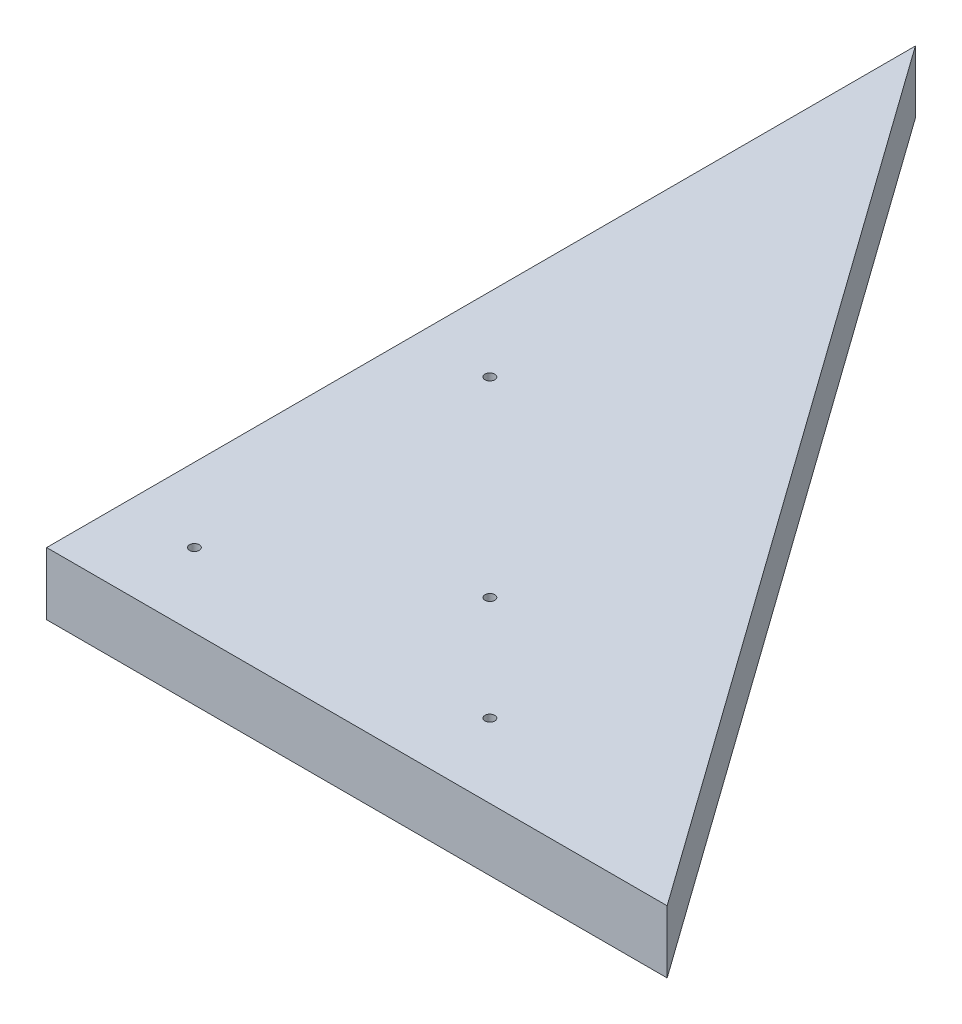
ISO-10303-21;
HEADER;
FILE_DESCRIPTION(('STEP AP214'),'2;1');
FILE_NAME('part.step','',(''),(''),'','','');
FILE_SCHEMA(('AUTOMOTIVE_DESIGN { 1 0 10303 214 1 1 1 1 }'));
ENDSEC;
DATA;
#1=APPLICATION_CONTEXT('core data for automotive mechanical design processes');
#2=APPLICATION_PROTOCOL_DEFINITION('international standard','automotive_design',2000,#1);
#3=PRODUCT_CONTEXT('',#1,'mechanical');
#4=PRODUCT('Part','Part','',(#3));
#5=PRODUCT_RELATED_PRODUCT_CATEGORY('part','',(#4));
#6=PRODUCT_DEFINITION_FORMATION('','',#4);
#7=PRODUCT_DEFINITION_CONTEXT('part definition',#1,'design');
#8=PRODUCT_DEFINITION('design','',#6,#7);
#9=PRODUCT_DEFINITION_SHAPE('','',#8);
#10=(LENGTH_UNIT() NAMED_UNIT(*) SI_UNIT(.MILLI.,.METRE.));
#11=(NAMED_UNIT(*) PLANE_ANGLE_UNIT() SI_UNIT($,.RADIAN.));
#12=(NAMED_UNIT(*) SI_UNIT($,.STERADIAN.) SOLID_ANGLE_UNIT());
#13=UNCERTAINTY_MEASURE_WITH_UNIT(LENGTH_MEASURE(1.E-05),#10,'distance_accuracy_value','');
#14=(GEOMETRIC_REPRESENTATION_CONTEXT(3) GLOBAL_UNCERTAINTY_ASSIGNED_CONTEXT((#13)) GLOBAL_UNIT_ASSIGNED_CONTEXT((#10,
#11,#12)) REPRESENTATION_CONTEXT('',''));
#15=CARTESIAN_POINT('',(0.,0.,0.));
#16=DIRECTION('',(0.,0.,1.));
#17=DIRECTION('',(1.,0.,0.));
#18=AXIS2_PLACEMENT_3D('',#15,#16,#17);
#19=CARTESIAN_POINT('',(-30.,229.478596729474,30.));
#20=DIRECTION('',(0.,-1.,0.));
#21=DIRECTION('',(0.,0.,-1.));
#22=AXIS2_PLACEMENT_3D('',#19,#20,#21);
#23=CYLINDRICAL_SURFACE('',#22,0.999999999999998);
#24=CARTESIAN_POINT('',(-30.,0.,30.));
#25=DIRECTION('',(0.,1.,0.));
#26=DIRECTION('',(0.,0.,1.));
#27=AXIS2_PLACEMENT_3D('',#24,#25,#26);
#28=CIRCLE('',#27,0.999999999999998);
#29=CARTESIAN_POINT('',(-30.,0.,31.));
#30=VERTEX_POINT('',#29);
#31=EDGE_CURVE('E95',#30,#30,#28,.T.);
#32=ORIENTED_EDGE('',*,*,#31,.F.);
#33=EDGE_LOOP('',(#32));
#34=FACE_BOUND('',#33,.T.);
#35=CARTESIAN_POINT('',(-30.,12.7,30.));
#36=DIRECTION('',(0.,1.,0.));
#37=DIRECTION('',(0.,0.,1.));
#38=AXIS2_PLACEMENT_3D('',#35,#36,#37);
#39=CIRCLE('',#38,0.999999999999998);
#40=CARTESIAN_POINT('',(-30.,12.7,31.));
#41=VERTEX_POINT('',#40);
#42=EDGE_CURVE('E86',#41,#41,#39,.T.);
#43=ORIENTED_EDGE('',*,*,#42,.T.);
#44=EDGE_LOOP('',(#43));
#45=FACE_BOUND('',#44,.T.);
#46=ADVANCED_FACE('F33',(#34,#45),#23,.F.);
#47=CARTESIAN_POINT('',(-45.,229.478596729474,45.));
#48=DIRECTION('',(1.,0.,0.));
#49=DIRECTION('',(0.,0.,-1.));
#50=AXIS2_PLACEMENT_3D('',#47,#48,#49);
#51=PLANE('',#50);
#52=DIRECTION('',(0.,0.,1.));
#53=VECTOR('',#52,1.);
#54=CARTESIAN_POINT('',(-45.,12.7,45.));
#55=LINE('',#54,#53);
#56=CARTESIAN_POINT('',(-45.,12.7,-131.4));
#57=VERTEX_POINT('',#56);
#58=CARTESIAN_POINT('',(-45.,12.7,45.));
#59=VERTEX_POINT('',#58);
#60=EDGE_CURVE('E69',#57,#59,#55,.T.);
#61=ORIENTED_EDGE('',*,*,#60,.F.);
#62=DIRECTION('',(0.,-1.,0.));
#63=VECTOR('',#62,1.);
#64=CARTESIAN_POINT('',(-45.,229.478596729474,-131.4));
#65=LINE('',#64,#63);
#66=CARTESIAN_POINT('',(-45.,0.,-131.4));
#67=VERTEX_POINT('',#66);
#68=EDGE_CURVE('E42',#57,#67,#65,.T.);
#69=ORIENTED_EDGE('',*,*,#68,.T.);
#70=DIRECTION('',(0.,0.,1.));
#71=VECTOR('',#70,1.);
#72=CARTESIAN_POINT('',(-45.,0.,45.));
#73=LINE('',#72,#71);
#74=CARTESIAN_POINT('',(-45.,0.,45.));
#75=VERTEX_POINT('',#74);
#76=EDGE_CURVE('E71',#67,#75,#73,.T.);
#77=ORIENTED_EDGE('',*,*,#76,.T.);
#78=DIRECTION('',(0.,-1.,0.));
#79=VECTOR('',#78,1.);
#80=CARTESIAN_POINT('',(-45.,229.478596729474,45.));
#81=LINE('',#80,#79);
#82=EDGE_CURVE('E65',#59,#75,#81,.T.);
#83=ORIENTED_EDGE('',*,*,#82,.F.);
#84=EDGE_LOOP('',(#61,#69,#77,#83));
#85=FACE_BOUND('',#84,.T.);
#86=ADVANCED_FACE('F67',(#85),#51,.F.);
#87=CARTESIAN_POINT('',(-45.,229.478596729474,-131.4));
#88=DIRECTION('',(-0.813733471206735,0.,0.581238193719096));
#89=DIRECTION('',(0.581238193719096,0.,0.813733471206735));
#90=AXIS2_PLACEMENT_3D('',#87,#88,#89);
#91=PLANE('',#90);
#92=DIRECTION('',(-0.581238193719096,0.,-0.813733471206735));
#93=VECTOR('',#92,1.);
#94=CARTESIAN_POINT('',(-45.,12.7,-131.4));
#95=LINE('',#94,#93);
#96=CARTESIAN_POINT('',(81.,12.7,45.));
#97=VERTEX_POINT('',#96);
#98=EDGE_CURVE('E52',#97,#57,#95,.T.);
#99=ORIENTED_EDGE('',*,*,#98,.F.);
#100=DIRECTION('',(0.,-1.,0.));
#101=VECTOR('',#100,1.);
#102=CARTESIAN_POINT('',(81.,229.478596729474,45.));
#103=LINE('',#102,#101);
#104=CARTESIAN_POINT('',(81.,0.,45.));
#105=VERTEX_POINT('',#104);
#106=EDGE_CURVE('E11',#97,#105,#103,.T.);
#107=ORIENTED_EDGE('',*,*,#106,.T.);
#108=DIRECTION('',(-0.581238193719096,0.,-0.813733471206735));
#109=VECTOR('',#108,1.);
#110=CARTESIAN_POINT('',(-45.,0.,-131.4));
#111=LINE('',#110,#109);
#112=EDGE_CURVE('E103',#105,#67,#111,.T.);
#113=ORIENTED_EDGE('',*,*,#112,.T.);
#114=ORIENTED_EDGE('',*,*,#68,.F.);
#115=EDGE_LOOP('',(#99,#107,#113,#114));
#116=FACE_BOUND('',#115,.T.);
#117=ADVANCED_FACE('F107',(#116),#91,.F.);
#118=CARTESIAN_POINT('',(81.,229.478596729474,45.));
#119=DIRECTION('',(0.,0.,-1.));
#120=DIRECTION('',(-1.,0.,0.));
#121=AXIS2_PLACEMENT_3D('',#118,#119,#120);
#122=PLANE('',#121);
#123=DIRECTION('',(1.,0.,0.));
#124=VECTOR('',#123,1.);
#125=CARTESIAN_POINT('',(81.,12.7,45.));
#126=LINE('',#125,#124);
#127=EDGE_CURVE('E77',#59,#97,#126,.T.);
#128=ORIENTED_EDGE('',*,*,#127,.F.);
#129=ORIENTED_EDGE('',*,*,#82,.T.);
#130=DIRECTION('',(1.,0.,0.));
#131=VECTOR('',#130,1.);
#132=CARTESIAN_POINT('',(81.,0.,45.));
#133=LINE('',#132,#131);
#134=EDGE_CURVE('E101',#75,#105,#133,.T.);
#135=ORIENTED_EDGE('',*,*,#134,.T.);
#136=ORIENTED_EDGE('',*,*,#106,.F.);
#137=EDGE_LOOP('',(#128,#129,#135,#136));
#138=FACE_BOUND('',#137,.T.);
#139=ADVANCED_FACE('F35',(#138),#122,.F.);
#140=CARTESIAN_POINT('',(-30.,229.478596729474,-30.));
#141=DIRECTION('',(0.,-1.,0.));
#142=DIRECTION('',(0.,0.,-1.));
#143=AXIS2_PLACEMENT_3D('',#140,#141,#142);
#144=CYLINDRICAL_SURFACE('',#143,0.999999999999998);
#145=CARTESIAN_POINT('',(-30.,0.,-30.));
#146=DIRECTION('',(0.,1.,0.));
#147=DIRECTION('',(0.,0.,1.));
#148=AXIS2_PLACEMENT_3D('',#145,#146,#147);
#149=CIRCLE('',#148,0.999999999999998);
#150=CARTESIAN_POINT('',(-30.,0.,-29.));
#151=VERTEX_POINT('',#150);
#152=EDGE_CURVE('E98',#151,#151,#149,.T.);
#153=ORIENTED_EDGE('',*,*,#152,.F.);
#154=EDGE_LOOP('',(#153));
#155=FACE_BOUND('',#154,.T.);
#156=CARTESIAN_POINT('',(-30.,12.7,-30.));
#157=DIRECTION('',(0.,1.,0.));
#158=DIRECTION('',(0.,0.,1.));
#159=AXIS2_PLACEMENT_3D('',#156,#157,#158);
#160=CIRCLE('',#159,0.999999999999998);
#161=CARTESIAN_POINT('',(-30.,12.7,-29.));
#162=VERTEX_POINT('',#161);
#163=EDGE_CURVE('E82',#162,#162,#160,.T.);
#164=ORIENTED_EDGE('',*,*,#163,.T.);
#165=EDGE_LOOP('',(#164));
#166=FACE_BOUND('',#165,.T.);
#167=ADVANCED_FACE('F140',(#155,#166),#144,.F.);
#168=CARTESIAN_POINT('',(8.78679656440357,229.478596729474,8.78679656440358));
#169=DIRECTION('',(0.,-1.,0.));
#170=DIRECTION('',(0.,0.,-1.));
#171=AXIS2_PLACEMENT_3D('',#168,#169,#170);
#172=CYLINDRICAL_SURFACE('',#171,1.);
#173=CARTESIAN_POINT('',(8.78679656440357,0.,8.78679656440358));
#174=DIRECTION('',(0.,1.,0.));
#175=DIRECTION('',(0.,0.,1.));
#176=AXIS2_PLACEMENT_3D('',#173,#174,#175);
#177=CIRCLE('',#176,1.);
#178=CARTESIAN_POINT('',(8.78679656440357,0.,9.78679656440358));
#179=VERTEX_POINT('',#178);
#180=EDGE_CURVE('E92',#179,#179,#177,.T.);
#181=ORIENTED_EDGE('',*,*,#180,.F.);
#182=EDGE_LOOP('',(#181));
#183=FACE_BOUND('',#182,.T.);
#184=CARTESIAN_POINT('',(8.78679656440357,12.7,8.78679656440358));
#185=DIRECTION('',(0.,1.,0.));
#186=DIRECTION('',(0.,0.,1.));
#187=AXIS2_PLACEMENT_3D('',#184,#185,#186);
#188=CIRCLE('',#187,1.);
#189=CARTESIAN_POINT('',(8.78679656440357,12.7,9.78679656440358));
#190=VERTEX_POINT('',#189);
#191=EDGE_CURVE('E126',#190,#190,#188,.T.);
#192=ORIENTED_EDGE('',*,*,#191,.T.);
#193=EDGE_LOOP('',(#192));
#194=FACE_BOUND('',#193,.T.);
#195=ADVANCED_FACE('F113',(#183,#194),#172,.F.);
#196=CARTESIAN_POINT('',(0.,0.,0.));
#197=DIRECTION('',(0.,-1.,0.));
#198=DIRECTION('',(0.,0.,-1.));
#199=AXIS2_PLACEMENT_3D('',#196,#197,#198);
#200=PLANE('',#199);
#201=ORIENTED_EDGE('',*,*,#180,.T.);
#202=EDGE_LOOP('',(#201));
#203=FACE_BOUND('',#202,.T.);
#204=ORIENTED_EDGE('',*,*,#152,.T.);
#205=EDGE_LOOP('',(#204));
#206=FACE_BOUND('',#205,.T.);
#207=ORIENTED_EDGE('',*,*,#134,.F.);
#208=ORIENTED_EDGE('',*,*,#76,.F.);
#209=ORIENTED_EDGE('',*,*,#112,.F.);
#210=EDGE_LOOP('',(#207,#208,#209));
#211=FACE_BOUND('',#210,.T.);
#212=ORIENTED_EDGE('',*,*,#31,.T.);
#213=EDGE_LOOP('',(#212));
#214=FACE_BOUND('',#213,.T.);
#215=CARTESIAN_POINT('',(30.,0.,30.));
#216=DIRECTION('',(0.,1.,0.));
#217=DIRECTION('',(0.,0.,1.));
#218=AXIS2_PLACEMENT_3D('',#215,#216,#217);
#219=CIRCLE('',#218,0.999999999999998);
#220=CARTESIAN_POINT('',(30.,0.,31.));
#221=VERTEX_POINT('',#220);
#222=EDGE_CURVE('E79',#221,#221,#219,.T.);
#223=ORIENTED_EDGE('',*,*,#222,.T.);
#224=EDGE_LOOP('',(#223));
#225=FACE_BOUND('',#224,.T.);
#226=ADVANCED_FACE('F109',(#203,#206,#211,#214,#225),#200,.T.);
#227=CARTESIAN_POINT('',(30.,229.478596729474,30.));
#228=DIRECTION('',(0.,-1.,0.));
#229=DIRECTION('',(0.,0.,-1.));
#230=AXIS2_PLACEMENT_3D('',#227,#228,#229);
#231=CYLINDRICAL_SURFACE('',#230,0.999999999999998);
#232=ORIENTED_EDGE('',*,*,#222,.F.);
#233=EDGE_LOOP('',(#232));
#234=FACE_BOUND('',#233,.T.);
#235=CARTESIAN_POINT('',(30.,12.7,30.));
#236=DIRECTION('',(0.,1.,0.));
#237=DIRECTION('',(0.,0.,1.));
#238=AXIS2_PLACEMENT_3D('',#235,#236,#237);
#239=CIRCLE('',#238,0.999999999999998);
#240=CARTESIAN_POINT('',(30.,12.7,31.));
#241=VERTEX_POINT('',#240);
#242=EDGE_CURVE('E37',#241,#241,#239,.T.);
#243=ORIENTED_EDGE('',*,*,#242,.T.);
#244=EDGE_LOOP('',(#243));
#245=FACE_BOUND('',#244,.T.);
#246=ADVANCED_FACE('F112',(#234,#245),#231,.F.);
#247=CARTESIAN_POINT('',(0.,12.7,0.));
#248=DIRECTION('',(0.,1.,0.));
#249=DIRECTION('',(0.,0.,1.));
#250=AXIS2_PLACEMENT_3D('',#247,#248,#249);
#251=PLANE('',#250);
#252=ORIENTED_EDGE('',*,*,#242,.F.);
#253=EDGE_LOOP('',(#252));
#254=FACE_BOUND('',#253,.T.);
#255=ORIENTED_EDGE('',*,*,#191,.F.);
#256=EDGE_LOOP('',(#255));
#257=FACE_BOUND('',#256,.T.);
#258=ORIENTED_EDGE('',*,*,#42,.F.);
#259=EDGE_LOOP('',(#258));
#260=FACE_BOUND('',#259,.T.);
#261=ORIENTED_EDGE('',*,*,#163,.F.);
#262=EDGE_LOOP('',(#261));
#263=FACE_BOUND('',#262,.T.);
#264=ORIENTED_EDGE('',*,*,#60,.T.);
#265=ORIENTED_EDGE('',*,*,#127,.T.);
#266=ORIENTED_EDGE('',*,*,#98,.T.);
#267=EDGE_LOOP('',(#264,#265,#266));
#268=FACE_BOUND('',#267,.T.);
#269=ADVANCED_FACE('F81',(#254,#257,#260,#263,#268),#251,.T.);
#270=CLOSED_SHELL('',(#46,#86,#117,#139,#167,#195,#226,#246,#269));
#271=MANIFOLD_SOLID_BREP('B2',#270);
#272=ADVANCED_BREP_SHAPE_REPRESENTATION('',(#18,#271),#14);
#273=SHAPE_DEFINITION_REPRESENTATION(#9,#272);
ENDSEC;
END-ISO-10303-21;
